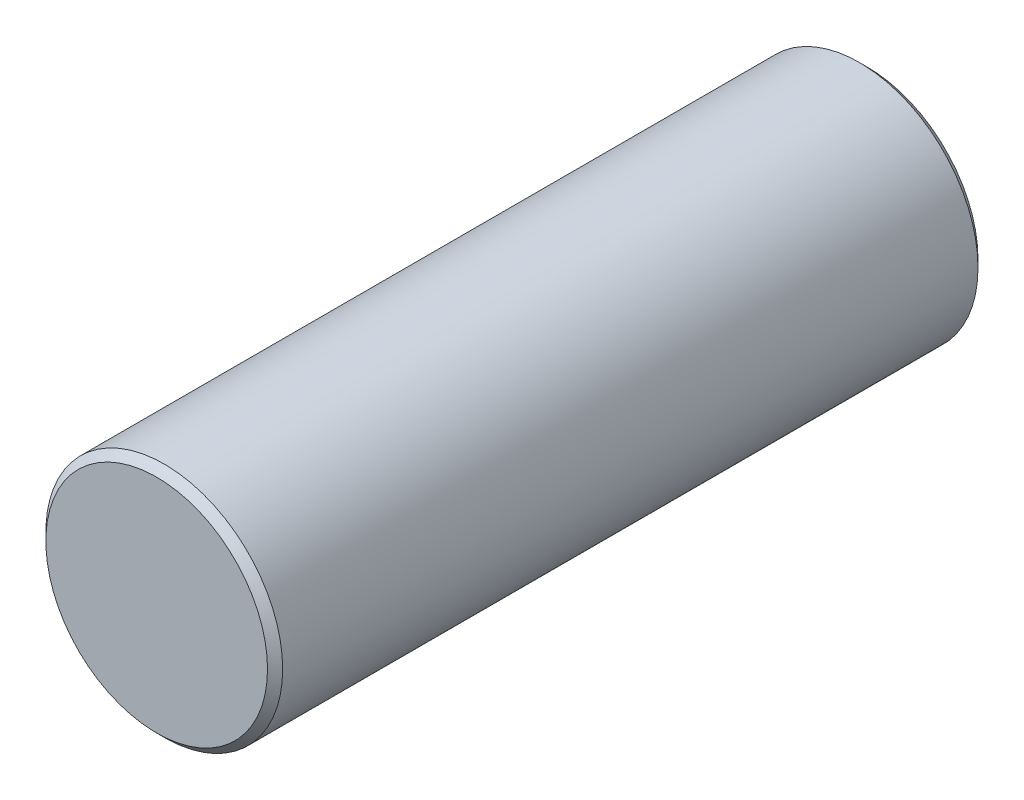
ISO-10303-21;
HEADER;
FILE_DESCRIPTION(('STEP AP214'),'2;1');
FILE_NAME('part.step','',(''),(''),'','','');
FILE_SCHEMA(('AUTOMOTIVE_DESIGN { 1 0 10303 214 1 1 1 1 }'));
ENDSEC;
DATA;
#1=APPLICATION_CONTEXT('core data for automotive mechanical design processes');
#2=APPLICATION_PROTOCOL_DEFINITION('international standard','automotive_design',2000,#1);
#3=PRODUCT_CONTEXT('',#1,'mechanical');
#4=PRODUCT('Part','Part','',(#3));
#5=PRODUCT_RELATED_PRODUCT_CATEGORY('part','',(#4));
#6=PRODUCT_DEFINITION_FORMATION('','',#4);
#7=PRODUCT_DEFINITION_CONTEXT('part definition',#1,'design');
#8=PRODUCT_DEFINITION('design','',#6,#7);
#9=PRODUCT_DEFINITION_SHAPE('','',#8);
#10=(LENGTH_UNIT() NAMED_UNIT(*) SI_UNIT(.MILLI.,.METRE.));
#11=(NAMED_UNIT(*) PLANE_ANGLE_UNIT() SI_UNIT($,.RADIAN.));
#12=(NAMED_UNIT(*) SI_UNIT($,.STERADIAN.) SOLID_ANGLE_UNIT());
#13=UNCERTAINTY_MEASURE_WITH_UNIT(LENGTH_MEASURE(1.E-05),#10,'distance_accuracy_value','');
#14=(GEOMETRIC_REPRESENTATION_CONTEXT(3) GLOBAL_UNCERTAINTY_ASSIGNED_CONTEXT((#13)) GLOBAL_UNIT_ASSIGNED_CONTEXT((#10,
#11,#12)) REPRESENTATION_CONTEXT('',''));
#15=CARTESIAN_POINT('',(0.,0.,0.));
#16=DIRECTION('',(0.,0.,1.));
#17=DIRECTION('',(1.,0.,0.));
#18=AXIS2_PLACEMENT_3D('',#15,#16,#17);
#19=CARTESIAN_POINT('',(0.,0.,19.05));
#20=DIRECTION('',(0.,0.,-1.));
#21=DIRECTION('',(-1.,0.,0.));
#22=AXIS2_PLACEMENT_3D('',#19,#20,#21);
#23=CYLINDRICAL_SURFACE('',#22,6.35);
#24=CARTESIAN_POINT('',(0.,0.,-18.6436));
#25=DIRECTION('',(0.,0.,1.));
#26=DIRECTION('',(1.,0.,0.));
#27=AXIS2_PLACEMENT_3D('',#24,#25,#26);
#28=CIRCLE('',#27,6.35);
#29=CARTESIAN_POINT('',(6.35,0.,-18.6436));
#30=VERTEX_POINT('',#29);
#31=EDGE_CURVE('E53',#30,#30,#28,.T.);
#32=ORIENTED_EDGE('',*,*,#31,.T.);
#33=EDGE_LOOP('',(#32));
#34=FACE_BOUND('',#33,.T.);
#35=CARTESIAN_POINT('',(0.,0.,18.6436));
#36=DIRECTION('',(0.,0.,1.));
#37=DIRECTION('',(1.,0.,0.));
#38=AXIS2_PLACEMENT_3D('',#35,#36,#37);
#39=CIRCLE('',#38,6.35);
#40=CARTESIAN_POINT('',(6.35,0.,18.6436));
#41=VERTEX_POINT('',#40);
#42=EDGE_CURVE('E57',#41,#41,#39,.F.);
#43=ORIENTED_EDGE('',*,*,#42,.T.);
#44=EDGE_LOOP('',(#43));
#45=FACE_BOUND('',#44,.T.);
#46=ADVANCED_FACE('F43',(#34,#45),#23,.T.);
#47=CARTESIAN_POINT('',(0.,0.,19.05));
#48=DIRECTION('',(0.,0.,1.));
#49=DIRECTION('',(1.,0.,0.));
#50=AXIS2_PLACEMENT_3D('',#47,#48,#49);
#51=PLANE('',#50);
#52=CARTESIAN_POINT('',(0.,0.,19.05));
#53=DIRECTION('',(0.,0.,1.));
#54=DIRECTION('',(1.,0.,0.));
#55=AXIS2_PLACEMENT_3D('',#52,#53,#54);
#56=CIRCLE('',#55,5.94360000000001);
#57=CARTESIAN_POINT('',(5.94360000000001,0.,19.05));
#58=VERTEX_POINT('',#57);
#59=EDGE_CURVE('E12',#58,#58,#56,.T.);
#60=ORIENTED_EDGE('',*,*,#59,.T.);
#61=EDGE_LOOP('',(#60));
#62=FACE_BOUND('',#61,.T.);
#63=ADVANCED_FACE('F76',(#62),#51,.T.);
#64=CARTESIAN_POINT('',(0.,0.,-19.05));
#65=DIRECTION('',(0.,0.,1.));
#66=DIRECTION('',(1.,0.,0.));
#67=AXIS2_PLACEMENT_3D('',#64,#65,#66);
#68=PLANE('',#67);
#69=CARTESIAN_POINT('',(0.,0.,-19.05));
#70=DIRECTION('',(0.,0.,1.));
#71=DIRECTION('',(1.,0.,0.));
#72=AXIS2_PLACEMENT_3D('',#69,#70,#71);
#73=CIRCLE('',#72,5.94359999999998);
#74=CARTESIAN_POINT('',(5.94359999999998,0.,-19.05));
#75=VERTEX_POINT('',#74);
#76=EDGE_CURVE('E49',#75,#75,#73,.F.);
#77=ORIENTED_EDGE('',*,*,#76,.T.);
#78=EDGE_LOOP('',(#77));
#79=FACE_BOUND('',#78,.T.);
#80=ADVANCED_FACE('F72',(#79),#68,.F.);
#81=CARTESIAN_POINT('',(0.,0.,-18.6436));
#82=DIRECTION('',(0.,0.,1.));
#83=DIRECTION('',(1.,0.,0.));
#84=AXIS2_PLACEMENT_3D('',#81,#82,#83);
#85=CONICAL_SURFACE('',#84,6.35,0.785398163397451);
#86=ORIENTED_EDGE('',*,*,#76,.F.);
#87=EDGE_LOOP('',(#86));
#88=FACE_BOUND('',#87,.T.);
#89=ORIENTED_EDGE('',*,*,#31,.F.);
#90=EDGE_LOOP('',(#89));
#91=FACE_BOUND('',#90,.T.);
#92=ADVANCED_FACE('F67',(#88,#91),#85,.T.);
#93=CARTESIAN_POINT('',(0.,0.,19.05));
#94=DIRECTION('',(0.,0.,-1.));
#95=DIRECTION('',(-1.,0.,0.));
#96=AXIS2_PLACEMENT_3D('',#93,#94,#95);
#97=CONICAL_SURFACE('',#96,5.94360000000001,0.785398163397443);
#98=ORIENTED_EDGE('',*,*,#42,.F.);
#99=EDGE_LOOP('',(#98));
#100=FACE_BOUND('',#99,.T.);
#101=ORIENTED_EDGE('',*,*,#59,.F.);
#102=EDGE_LOOP('',(#101));
#103=FACE_BOUND('',#102,.T.);
#104=ADVANCED_FACE('F64',(#100,#103),#97,.T.);
#105=CLOSED_SHELL('',(#46,#63,#80,#92,#104));
#106=MANIFOLD_SOLID_BREP('B2',#105);
#107=ADVANCED_BREP_SHAPE_REPRESENTATION('',(#18,#106),#14);
#108=SHAPE_DEFINITION_REPRESENTATION(#9,#107);
ENDSEC;
END-ISO-10303-21;
